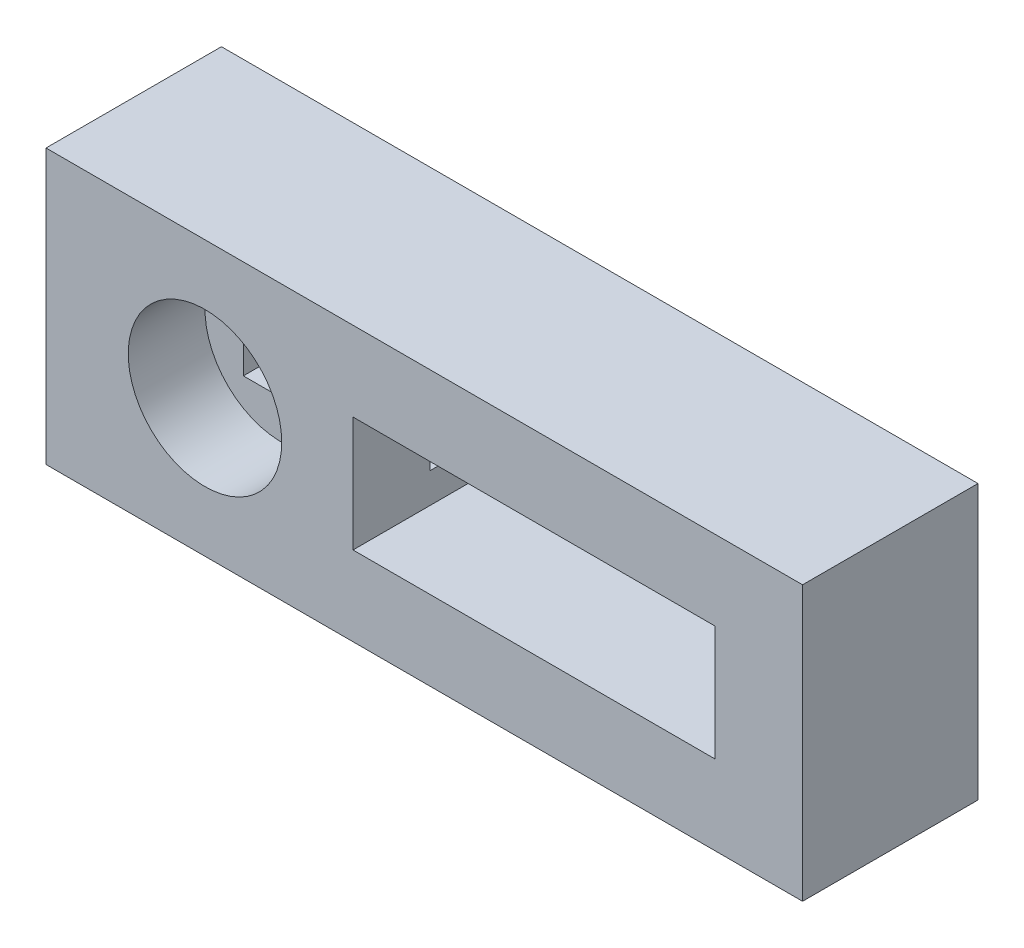
ISO-10303-21;
HEADER;
FILE_DESCRIPTION(('STEP AP214'),'2;1');
FILE_NAME('part.step','',(''),(''),'','','');
FILE_SCHEMA(('AUTOMOTIVE_DESIGN { 1 0 10303 214 1 1 1 1 }'));
ENDSEC;
DATA;
#1=APPLICATION_CONTEXT('core data for automotive mechanical design processes');
#2=APPLICATION_PROTOCOL_DEFINITION('international standard','automotive_design',2000,#1);
#3=PRODUCT_CONTEXT('',#1,'mechanical');
#4=PRODUCT('Part','Part','',(#3));
#5=PRODUCT_RELATED_PRODUCT_CATEGORY('part','',(#4));
#6=PRODUCT_DEFINITION_FORMATION('','',#4);
#7=PRODUCT_DEFINITION_CONTEXT('part definition',#1,'design');
#8=PRODUCT_DEFINITION('design','',#6,#7);
#9=PRODUCT_DEFINITION_SHAPE('','',#8);
#10=(LENGTH_UNIT() NAMED_UNIT(*) SI_UNIT(.MILLI.,.METRE.));
#11=(NAMED_UNIT(*) PLANE_ANGLE_UNIT() SI_UNIT($,.RADIAN.));
#12=(NAMED_UNIT(*) SI_UNIT($,.STERADIAN.) SOLID_ANGLE_UNIT());
#13=UNCERTAINTY_MEASURE_WITH_UNIT(LENGTH_MEASURE(1.E-05),#10,'distance_accuracy_value','');
#14=(GEOMETRIC_REPRESENTATION_CONTEXT(3) GLOBAL_UNCERTAINTY_ASSIGNED_CONTEXT((#13)) GLOBAL_UNIT_ASSIGNED_CONTEXT((#10,
#11,#12)) REPRESENTATION_CONTEXT('',''));
#15=CARTESIAN_POINT('',(0.,0.,0.));
#16=DIRECTION('',(0.,0.,1.));
#17=DIRECTION('',(1.,0.,0.));
#18=AXIS2_PLACEMENT_3D('',#15,#16,#17);
#19=CARTESIAN_POINT('',(0.,12.5,16.));
#20=DIRECTION('',(-1.,0.,0.));
#21=DIRECTION('',(0.,-1.,0.));
#22=AXIS2_PLACEMENT_3D('',#19,#20,#21);
#23=PLANE('',#22);
#24=DIRECTION('',(0.,1.,0.));
#25=VECTOR('',#24,1.);
#26=CARTESIAN_POINT('',(0.,12.5,0.));
#27=LINE('',#26,#25);
#28=CARTESIAN_POINT('',(0.,-12.5,0.));
#29=VERTEX_POINT('',#28);
#30=CARTESIAN_POINT('',(0.,12.5,0.));
#31=VERTEX_POINT('',#30);
#32=EDGE_CURVE('E335',#29,#31,#27,.T.);
#33=ORIENTED_EDGE('',*,*,#32,.T.);
#34=DIRECTION('',(0.,0.,-1.));
#35=VECTOR('',#34,1.);
#36=CARTESIAN_POINT('',(0.,12.5,16.));
#37=LINE('',#36,#35);
#38=CARTESIAN_POINT('',(0.,12.5,16.));
#39=VERTEX_POINT('',#38);
#40=EDGE_CURVE('E364',#39,#31,#37,.T.);
#41=ORIENTED_EDGE('',*,*,#40,.F.);
#42=DIRECTION('',(0.,1.,0.));
#43=VECTOR('',#42,1.);
#44=CARTESIAN_POINT('',(0.,12.5,16.));
#45=LINE('',#44,#43);
#46=CARTESIAN_POINT('',(0.,-12.5,16.));
#47=VERTEX_POINT('',#46);
#48=EDGE_CURVE('E338',#47,#39,#45,.T.);
#49=ORIENTED_EDGE('',*,*,#48,.F.);
#50=DIRECTION('',(0.,0.,-1.));
#51=VECTOR('',#50,1.);
#52=CARTESIAN_POINT('',(0.,-12.5,16.));
#53=LINE('',#52,#51);
#54=EDGE_CURVE('E348',#47,#29,#53,.T.);
#55=ORIENTED_EDGE('',*,*,#54,.T.);
#56=EDGE_LOOP('',(#33,#41,#49,#55));
#57=FACE_BOUND('',#56,.T.);
#58=ADVANCED_FACE('F33',(#57),#23,.F.);
#59=CARTESIAN_POINT('',(0.,12.5,16.));
#60=DIRECTION('',(0.,-1.,0.));
#61=DIRECTION('',(1.,0.,0.));
#62=AXIS2_PLACEMENT_3D('',#59,#60,#61);
#63=PLANE('',#62);
#64=DIRECTION('',(-1.,0.,0.));
#65=VECTOR('',#64,1.);
#66=CARTESIAN_POINT('',(0.,12.5,0.));
#67=LINE('',#66,#65);
#68=CARTESIAN_POINT('',(-69.,12.5,0.));
#69=VERTEX_POINT('',#68);
#70=EDGE_CURVE('E351',#31,#69,#67,.T.);
#71=ORIENTED_EDGE('',*,*,#70,.T.);
#72=DIRECTION('',(0.,0.,-1.));
#73=VECTOR('',#72,1.);
#74=CARTESIAN_POINT('',(-69.,12.5,16.));
#75=LINE('',#74,#73);
#76=CARTESIAN_POINT('',(-69.,12.5,16.));
#77=VERTEX_POINT('',#76);
#78=EDGE_CURVE('E361',#77,#69,#75,.T.);
#79=ORIENTED_EDGE('',*,*,#78,.F.);
#80=DIRECTION('',(-1.,0.,0.));
#81=VECTOR('',#80,1.);
#82=CARTESIAN_POINT('',(0.,12.5,16.));
#83=LINE('',#82,#81);
#84=EDGE_CURVE('E341',#39,#77,#83,.T.);
#85=ORIENTED_EDGE('',*,*,#84,.F.);
#86=ORIENTED_EDGE('',*,*,#40,.T.);
#87=EDGE_LOOP('',(#71,#79,#85,#86));
#88=FACE_BOUND('',#87,.T.);
#89=ADVANCED_FACE('F407',(#88),#63,.F.);
#90=CARTESIAN_POINT('',(-69.,12.5,16.));
#91=DIRECTION('',(1.,0.,0.));
#92=DIRECTION('',(0.,0.,-1.));
#93=AXIS2_PLACEMENT_3D('',#90,#91,#92);
#94=PLANE('',#93);
#95=DIRECTION('',(0.,-1.,0.));
#96=VECTOR('',#95,1.);
#97=CARTESIAN_POINT('',(-69.,12.5,0.));
#98=LINE('',#97,#96);
#99=CARTESIAN_POINT('',(-69.,-12.5,0.));
#100=VERTEX_POINT('',#99);
#101=EDGE_CURVE('E353',#69,#100,#98,.T.);
#102=ORIENTED_EDGE('',*,*,#101,.T.);
#103=DIRECTION('',(0.,0.,-1.));
#104=VECTOR('',#103,1.);
#105=CARTESIAN_POINT('',(-69.,-12.5,16.));
#106=LINE('',#105,#104);
#107=CARTESIAN_POINT('',(-69.,-12.5,16.));
#108=VERTEX_POINT('',#107);
#109=EDGE_CURVE('E358',#108,#100,#106,.T.);
#110=ORIENTED_EDGE('',*,*,#109,.F.);
#111=DIRECTION('',(0.,-1.,0.));
#112=VECTOR('',#111,1.);
#113=CARTESIAN_POINT('',(-69.,12.5,16.));
#114=LINE('',#113,#112);
#115=EDGE_CURVE('E344',#77,#108,#114,.T.);
#116=ORIENTED_EDGE('',*,*,#115,.F.);
#117=ORIENTED_EDGE('',*,*,#78,.T.);
#118=EDGE_LOOP('',(#102,#110,#116,#117));
#119=FACE_BOUND('',#118,.T.);
#120=ADVANCED_FACE('F412',(#119),#94,.F.);
#121=CARTESIAN_POINT('',(0.,-12.5,16.));
#122=DIRECTION('',(0.,1.,0.));
#123=DIRECTION('',(-1.,0.,0.));
#124=AXIS2_PLACEMENT_3D('',#121,#122,#123);
#125=PLANE('',#124);
#126=DIRECTION('',(1.,0.,0.));
#127=VECTOR('',#126,1.);
#128=CARTESIAN_POINT('',(0.,-12.5,0.));
#129=LINE('',#128,#127);
#130=EDGE_CURVE('E342',#100,#29,#129,.T.);
#131=ORIENTED_EDGE('',*,*,#130,.T.);
#132=ORIENTED_EDGE('',*,*,#54,.F.);
#133=DIRECTION('',(1.,0.,0.));
#134=VECTOR('',#133,1.);
#135=CARTESIAN_POINT('',(0.,-12.5,16.));
#136=LINE('',#135,#134);
#137=EDGE_CURVE('E346',#108,#47,#136,.T.);
#138=ORIENTED_EDGE('',*,*,#137,.F.);
#139=ORIENTED_EDGE('',*,*,#109,.T.);
#140=EDGE_LOOP('',(#131,#132,#138,#139));
#141=FACE_BOUND('',#140,.T.);
#142=ADVANCED_FACE('F427',(#141),#125,.F.);
#143=CARTESIAN_POINT('',(0.,0.,16.));
#144=DIRECTION('',(0.,0.,-1.));
#145=DIRECTION('',(-1.,0.,0.));
#146=AXIS2_PLACEMENT_3D('',#143,#144,#145);
#147=PLANE('',#146);
#148=DIRECTION('',(-1.,0.,0.));
#149=VECTOR('',#148,1.);
#150=CARTESIAN_POINT('',(-41.,-5.25000000000001,16.));
#151=LINE('',#150,#149);
#152=CARTESIAN_POINT('',(-8.00000000000001,-5.25000000000001,16.));
#153=VERTEX_POINT('',#152);
#154=CARTESIAN_POINT('',(-41.,-5.25000000000001,16.));
#155=VERTEX_POINT('',#154);
#156=EDGE_CURVE('E259',#153,#155,#151,.T.);
#157=ORIENTED_EDGE('',*,*,#156,.T.);
#158=DIRECTION('',(0.,1.,0.));
#159=VECTOR('',#158,1.);
#160=CARTESIAN_POINT('',(-41.,5.25000000000001,16.));
#161=LINE('',#160,#159);
#162=CARTESIAN_POINT('',(-41.,5.25000000000001,16.));
#163=VERTEX_POINT('',#162);
#164=EDGE_CURVE('E249',#155,#163,#161,.T.);
#165=ORIENTED_EDGE('',*,*,#164,.T.);
#166=DIRECTION('',(1.,0.,0.));
#167=VECTOR('',#166,1.);
#168=CARTESIAN_POINT('',(-41.,5.25000000000001,16.));
#169=LINE('',#168,#167);
#170=CARTESIAN_POINT('',(-8.00000000000001,5.24999999999999,16.));
#171=VERTEX_POINT('',#170);
#172=EDGE_CURVE('E252',#163,#171,#169,.T.);
#173=ORIENTED_EDGE('',*,*,#172,.T.);
#174=DIRECTION('',(0.,-1.,0.));
#175=VECTOR('',#174,1.);
#176=CARTESIAN_POINT('',(-8.00000000000001,5.24999999999999,16.));
#177=LINE('',#176,#175);
#178=EDGE_CURVE('E256',#171,#153,#177,.T.);
#179=ORIENTED_EDGE('',*,*,#178,.T.);
#180=EDGE_LOOP('',(#157,#165,#173,#179));
#181=FACE_BOUND('',#180,.T.);
#182=CARTESIAN_POINT('',(-54.5,0.,16.));
#183=DIRECTION('',(0.,0.,1.));
#184=DIRECTION('',(1.,0.,0.));
#185=AXIS2_PLACEMENT_3D('',#182,#183,#184);
#186=CIRCLE('',#185,7.);
#187=CARTESIAN_POINT('',(-47.5,0.,16.));
#188=VERTEX_POINT('',#187);
#189=EDGE_CURVE('E325',#188,#188,#186,.T.);
#190=ORIENTED_EDGE('',*,*,#189,.F.);
#191=EDGE_LOOP('',(#190));
#192=FACE_BOUND('',#191,.T.);
#193=ORIENTED_EDGE('',*,*,#48,.T.);
#194=ORIENTED_EDGE('',*,*,#84,.T.);
#195=ORIENTED_EDGE('',*,*,#115,.T.);
#196=ORIENTED_EDGE('',*,*,#137,.T.);
#197=EDGE_LOOP('',(#193,#194,#195,#196));
#198=FACE_BOUND('',#197,.T.);
#199=ADVANCED_FACE('F423',(#181,#192,#198),#147,.F.);
#200=CARTESIAN_POINT('',(0.,0.,0.));
#201=DIRECTION('',(0.,0.,-1.));
#202=DIRECTION('',(-1.,0.,0.));
#203=AXIS2_PLACEMENT_3D('',#200,#201,#202);
#204=PLANE('',#203);
#205=DIRECTION('',(1.,0.,0.));
#206=VECTOR('',#205,1.);
#207=CARTESIAN_POINT('',(-41.,2.49999999999999,0.));
#208=LINE('',#207,#206);
#209=CARTESIAN_POINT('',(-46.,2.5,0.));
#210=VERTEX_POINT('',#209);
#211=CARTESIAN_POINT('',(-41.,2.49999999999999,0.));
#212=VERTEX_POINT('',#211);
#213=EDGE_CURVE('E210',#210,#212,#208,.T.);
#214=ORIENTED_EDGE('',*,*,#213,.F.);
#215=DIRECTION('',(0.,1.,0.));
#216=VECTOR('',#215,1.);
#217=CARTESIAN_POINT('',(-46.,-2.5,0.));
#218=LINE('',#217,#216);
#219=CARTESIAN_POINT('',(-46.,-2.5,0.));
#220=VERTEX_POINT('',#219);
#221=EDGE_CURVE('E670',#220,#210,#218,.T.);
#222=ORIENTED_EDGE('',*,*,#221,.F.);
#223=DIRECTION('',(-1.,0.,0.));
#224=VECTOR('',#223,1.);
#225=CARTESIAN_POINT('',(-41.,-2.5,0.));
#226=LINE('',#225,#224);
#227=CARTESIAN_POINT('',(-41.,-2.5,0.));
#228=VERTEX_POINT('',#227);
#229=EDGE_CURVE('E243',#228,#220,#226,.T.);
#230=ORIENTED_EDGE('',*,*,#229,.F.);
#231=DIRECTION('',(0.,1.,0.));
#232=VECTOR('',#231,1.);
#233=CARTESIAN_POINT('',(-41.,5.25000000000001,0.));
#234=LINE('',#233,#232);
#235=CARTESIAN_POINT('',(-41.,-5.25000000000001,0.));
#236=VERTEX_POINT('',#235);
#237=EDGE_CURVE('E215',#236,#228,#234,.T.);
#238=ORIENTED_EDGE('',*,*,#237,.F.);
#239=DIRECTION('',(-1.,0.,0.));
#240=VECTOR('',#239,1.);
#241=CARTESIAN_POINT('',(-41.,-5.25000000000001,0.));
#242=LINE('',#241,#240);
#243=CARTESIAN_POINT('',(-8.00000000000001,-5.25000000000001,0.));
#244=VERTEX_POINT('',#243);
#245=EDGE_CURVE('E253',#244,#236,#242,.T.);
#246=ORIENTED_EDGE('',*,*,#245,.F.);
#247=DIRECTION('',(0.,-1.,0.));
#248=VECTOR('',#247,1.);
#249=CARTESIAN_POINT('',(-8.00000000000001,5.24999999999999,0.));
#250=LINE('',#249,#248);
#251=CARTESIAN_POINT('',(-8.,-2.5,0.));
#252=VERTEX_POINT('',#251);
#253=EDGE_CURVE('E268',#252,#244,#250,.T.);
#254=ORIENTED_EDGE('',*,*,#253,.F.);
#255=DIRECTION('',(-1.,0.,0.));
#256=VECTOR('',#255,1.);
#257=CARTESIAN_POINT('',(-8.,-2.5,0.));
#258=LINE('',#257,#256);
#259=CARTESIAN_POINT('',(-3.,-2.5,0.));
#260=VERTEX_POINT('',#259);
#261=EDGE_CURVE('E225',#260,#252,#258,.T.);
#262=ORIENTED_EDGE('',*,*,#261,.F.);
#263=DIRECTION('',(0.,-1.,0.));
#264=VECTOR('',#263,1.);
#265=CARTESIAN_POINT('',(-3.,-2.5,0.));
#266=LINE('',#265,#264);
#267=CARTESIAN_POINT('',(-3.,2.5,0.));
#268=VERTEX_POINT('',#267);
#269=EDGE_CURVE('E235',#268,#260,#266,.T.);
#270=ORIENTED_EDGE('',*,*,#269,.F.);
#271=DIRECTION('',(1.,0.,0.));
#272=VECTOR('',#271,1.);
#273=CARTESIAN_POINT('',(-8.,2.5,0.));
#274=LINE('',#273,#272);
#275=CARTESIAN_POINT('',(-8.,2.5,0.));
#276=VERTEX_POINT('',#275);
#277=EDGE_CURVE('E232',#276,#268,#274,.T.);
#278=ORIENTED_EDGE('',*,*,#277,.F.);
#279=CARTESIAN_POINT('',(-8.00000000000001,5.24999999999999,0.));
#280=VERTEX_POINT('',#279);
#281=EDGE_CURVE('E269',#280,#276,#250,.T.);
#282=ORIENTED_EDGE('',*,*,#281,.F.);
#283=DIRECTION('',(1.,0.,0.));
#284=VECTOR('',#283,1.);
#285=CARTESIAN_POINT('',(-41.,5.25000000000001,0.));
#286=LINE('',#285,#284);
#287=CARTESIAN_POINT('',(-41.,5.25000000000001,0.));
#288=VERTEX_POINT('',#287);
#289=EDGE_CURVE('E264',#288,#280,#286,.T.);
#290=ORIENTED_EDGE('',*,*,#289,.F.);
#291=EDGE_CURVE('E265',#212,#288,#234,.T.);
#292=ORIENTED_EDGE('',*,*,#291,.F.);
#293=EDGE_LOOP('',(#214,#222,#230,#238,#246,#254,#262,#270,#278,#282,#290,#292));
#294=FACE_BOUND('',#293,.T.);
#295=DIRECTION('',(0.,1.,0.));
#296=VECTOR('',#295,1.);
#297=CARTESIAN_POINT('',(-61.,0.,0.));
#298=LINE('',#297,#296);
#299=CARTESIAN_POINT('',(-61.,-6.5,0.));
#300=VERTEX_POINT('',#299);
#301=CARTESIAN_POINT('',(-61.,6.5,0.));
#302=VERTEX_POINT('',#301);
#303=EDGE_CURVE('E11',#300,#302,#298,.T.);
#304=ORIENTED_EDGE('',*,*,#303,.F.);
#305=DIRECTION('',(-1.,0.,0.));
#306=VECTOR('',#305,1.);
#307=CARTESIAN_POINT('',(0.,-6.5,0.));
#308=LINE('',#307,#306);
#309=CARTESIAN_POINT('',(-48.,-6.5,0.));
#310=VERTEX_POINT('',#309);
#311=EDGE_CURVE('E367',#310,#300,#308,.T.);
#312=ORIENTED_EDGE('',*,*,#311,.F.);
#313=DIRECTION('',(0.,-1.,0.));
#314=VECTOR('',#313,1.);
#315=CARTESIAN_POINT('',(-48.,0.,0.));
#316=LINE('',#315,#314);
#317=CARTESIAN_POINT('',(-48.,6.5,0.));
#318=VERTEX_POINT('',#317);
#319=EDGE_CURVE('E369',#318,#310,#316,.T.);
#320=ORIENTED_EDGE('',*,*,#319,.F.);
#321=DIRECTION('',(1.,0.,0.));
#322=VECTOR('',#321,1.);
#323=CARTESIAN_POINT('',(0.,6.5,0.));
#324=LINE('',#323,#322);
#325=EDGE_CURVE('E40',#302,#318,#324,.T.);
#326=ORIENTED_EDGE('',*,*,#325,.F.);
#327=EDGE_LOOP('',(#304,#312,#320,#326));
#328=FACE_BOUND('',#327,.T.);
#329=ORIENTED_EDGE('',*,*,#32,.F.);
#330=ORIENTED_EDGE('',*,*,#130,.F.);
#331=ORIENTED_EDGE('',*,*,#101,.F.);
#332=ORIENTED_EDGE('',*,*,#70,.F.);
#333=EDGE_LOOP('',(#329,#330,#331,#332));
#334=FACE_BOUND('',#333,.T.);
#335=ADVANCED_FACE('F384',(#294,#328,#334),#204,.T.);
#336=CARTESIAN_POINT('',(-54.5,0.,9.));
#337=DIRECTION('',(0.,0.,1.));
#338=DIRECTION('',(1.,0.,0.));
#339=AXIS2_PLACEMENT_3D('',#336,#337,#338);
#340=CYLINDRICAL_SURFACE('',#339,7.);
#341=CARTESIAN_POINT('',(-54.5,0.,9.));
#342=DIRECTION('',(0.,0.,1.));
#343=DIRECTION('',(1.,0.,0.));
#344=AXIS2_PLACEMENT_3D('',#341,#342,#343);
#345=CIRCLE('',#344,7.);
#346=CARTESIAN_POINT('',(-47.5,0.,9.));
#347=VERTEX_POINT('',#346);
#348=EDGE_CURVE('E332',#347,#347,#345,.T.);
#349=ORIENTED_EDGE('',*,*,#348,.F.);
#350=EDGE_LOOP('',(#349));
#351=FACE_BOUND('',#350,.T.);
#352=ORIENTED_EDGE('',*,*,#189,.T.);
#353=EDGE_LOOP('',(#352));
#354=FACE_BOUND('',#353,.T.);
#355=ADVANCED_FACE('F438',(#351,#354),#340,.F.);
#356=CARTESIAN_POINT('',(-54.5,0.,9.));
#357=DIRECTION('',(0.,0.,1.));
#358=DIRECTION('',(1.,0.,0.));
#359=AXIS2_PLACEMENT_3D('',#356,#357,#358);
#360=PLANE('',#359);
#361=DIRECTION('',(0.,-1.,0.));
#362=VECTOR('',#361,1.);
#363=CARTESIAN_POINT('',(-58.,-3.5,9.));
#364=LINE('',#363,#362);
#365=CARTESIAN_POINT('',(-58.,3.5,9.));
#366=VERTEX_POINT('',#365);
#367=CARTESIAN_POINT('',(-58.,-3.5,9.));
#368=VERTEX_POINT('',#367);
#369=EDGE_CURVE('E298',#366,#368,#364,.T.);
#370=ORIENTED_EDGE('',*,*,#369,.F.);
#371=DIRECTION('',(-1.,0.,0.));
#372=VECTOR('',#371,1.);
#373=CARTESIAN_POINT('',(-58.,3.5,9.));
#374=LINE('',#373,#372);
#375=CARTESIAN_POINT('',(-51.,3.5,9.));
#376=VERTEX_POINT('',#375);
#377=EDGE_CURVE('E307',#376,#366,#374,.T.);
#378=ORIENTED_EDGE('',*,*,#377,.F.);
#379=DIRECTION('',(0.,1.,0.));
#380=VECTOR('',#379,1.);
#381=CARTESIAN_POINT('',(-51.,-3.5,9.));
#382=LINE('',#381,#380);
#383=CARTESIAN_POINT('',(-51.,-3.5,9.));
#384=VERTEX_POINT('',#383);
#385=EDGE_CURVE('E319',#384,#376,#382,.T.);
#386=ORIENTED_EDGE('',*,*,#385,.F.);
#387=DIRECTION('',(1.,0.,0.));
#388=VECTOR('',#387,1.);
#389=CARTESIAN_POINT('',(-58.,-3.5,9.));
#390=LINE('',#389,#388);
#391=EDGE_CURVE('E316',#368,#384,#390,.T.);
#392=ORIENTED_EDGE('',*,*,#391,.F.);
#393=EDGE_LOOP('',(#370,#378,#386,#392));
#394=FACE_BOUND('',#393,.T.);
#395=ORIENTED_EDGE('',*,*,#348,.T.);
#396=EDGE_LOOP('',(#395));
#397=FACE_BOUND('',#396,.T.);
#398=ADVANCED_FACE('F445',(#394,#397),#360,.T.);
#399=CARTESIAN_POINT('',(-58.,-3.5,7.));
#400=DIRECTION('',(-1.,0.,0.));
#401=DIRECTION('',(0.,0.,1.));
#402=AXIS2_PLACEMENT_3D('',#399,#400,#401);
#403=PLANE('',#402);
#404=ORIENTED_EDGE('',*,*,#369,.T.);
#405=DIRECTION('',(0.,0.,1.));
#406=VECTOR('',#405,1.);
#407=CARTESIAN_POINT('',(-58.,-3.5,7.));
#408=LINE('',#407,#406);
#409=CARTESIAN_POINT('',(-58.,-3.5,7.));
#410=VERTEX_POINT('',#409);
#411=EDGE_CURVE('E313',#410,#368,#408,.T.);
#412=ORIENTED_EDGE('',*,*,#411,.F.);
#413=DIRECTION('',(0.,-1.,0.));
#414=VECTOR('',#413,1.);
#415=CARTESIAN_POINT('',(-58.,-3.5,7.));
#416=LINE('',#415,#414);
#417=CARTESIAN_POINT('',(-58.,3.5,7.));
#418=VERTEX_POINT('',#417);
#419=EDGE_CURVE('E304',#418,#410,#416,.T.);
#420=ORIENTED_EDGE('',*,*,#419,.F.);
#421=DIRECTION('',(0.,0.,1.));
#422=VECTOR('',#421,1.);
#423=CARTESIAN_POINT('',(-58.,3.5,7.));
#424=LINE('',#423,#422);
#425=EDGE_CURVE('E323',#418,#366,#424,.T.);
#426=ORIENTED_EDGE('',*,*,#425,.T.);
#427=EDGE_LOOP('',(#404,#412,#420,#426));
#428=FACE_BOUND('',#427,.T.);
#429=ADVANCED_FACE('F449',(#428),#403,.F.);
#430=CARTESIAN_POINT('',(-58.,3.5,7.));
#431=DIRECTION('',(0.,1.,0.));
#432=DIRECTION('',(0.,0.,1.));
#433=AXIS2_PLACEMENT_3D('',#430,#431,#432);
#434=PLANE('',#433);
#435=ORIENTED_EDGE('',*,*,#377,.T.);
#436=ORIENTED_EDGE('',*,*,#425,.F.);
#437=DIRECTION('',(-1.,0.,0.));
#438=VECTOR('',#437,1.);
#439=CARTESIAN_POINT('',(-58.,3.5,7.));
#440=LINE('',#439,#438);
#441=CARTESIAN_POINT('',(-51.,3.5,7.));
#442=VERTEX_POINT('',#441);
#443=EDGE_CURVE('E311',#442,#418,#440,.T.);
#444=ORIENTED_EDGE('',*,*,#443,.F.);
#445=DIRECTION('',(0.,0.,1.));
#446=VECTOR('',#445,1.);
#447=CARTESIAN_POINT('',(-51.,3.5,7.));
#448=LINE('',#447,#446);
#449=EDGE_CURVE('E326',#442,#376,#448,.T.);
#450=ORIENTED_EDGE('',*,*,#449,.T.);
#451=EDGE_LOOP('',(#435,#436,#444,#450));
#452=FACE_BOUND('',#451,.T.);
#453=ADVANCED_FACE('F453',(#452),#434,.F.);
#454=CARTESIAN_POINT('',(-51.,-3.5,7.));
#455=DIRECTION('',(1.,0.,0.));
#456=DIRECTION('',(0.,0.,-1.));
#457=AXIS2_PLACEMENT_3D('',#454,#455,#456);
#458=PLANE('',#457);
#459=ORIENTED_EDGE('',*,*,#385,.T.);
#460=ORIENTED_EDGE('',*,*,#449,.F.);
#461=DIRECTION('',(0.,1.,0.));
#462=VECTOR('',#461,1.);
#463=CARTESIAN_POINT('',(-51.,-3.5,7.));
#464=LINE('',#463,#462);
#465=CARTESIAN_POINT('',(-51.,-3.5,7.));
#466=VERTEX_POINT('',#465);
#467=EDGE_CURVE('E309',#466,#442,#464,.T.);
#468=ORIENTED_EDGE('',*,*,#467,.F.);
#469=DIRECTION('',(0.,0.,1.));
#470=VECTOR('',#469,1.);
#471=CARTESIAN_POINT('',(-51.,-3.5,7.));
#472=LINE('',#471,#470);
#473=EDGE_CURVE('E329',#466,#384,#472,.T.);
#474=ORIENTED_EDGE('',*,*,#473,.T.);
#475=EDGE_LOOP('',(#459,#460,#468,#474));
#476=FACE_BOUND('',#475,.T.);
#477=ADVANCED_FACE('F458',(#476),#458,.F.);
#478=CARTESIAN_POINT('',(-58.,-3.5,7.));
#479=DIRECTION('',(0.,-1.,0.));
#480=DIRECTION('',(0.,0.,-1.));
#481=AXIS2_PLACEMENT_3D('',#478,#479,#480);
#482=PLANE('',#481);
#483=ORIENTED_EDGE('',*,*,#391,.T.);
#484=ORIENTED_EDGE('',*,*,#473,.F.);
#485=DIRECTION('',(1.,0.,0.));
#486=VECTOR('',#485,1.);
#487=CARTESIAN_POINT('',(-58.,-3.5,7.));
#488=LINE('',#487,#486);
#489=EDGE_CURVE('E306',#410,#466,#488,.T.);
#490=ORIENTED_EDGE('',*,*,#489,.F.);
#491=ORIENTED_EDGE('',*,*,#411,.T.);
#492=EDGE_LOOP('',(#483,#484,#490,#491));
#493=FACE_BOUND('',#492,.T.);
#494=ADVANCED_FACE('F455',(#493),#482,.F.);
#495=CARTESIAN_POINT('',(-61.,6.5,-0.999999999999999));
#496=DIRECTION('',(-1.,0.,0.));
#497=DIRECTION('',(0.,0.,1.));
#498=AXIS2_PLACEMENT_3D('',#495,#496,#497);
#499=PLANE('',#498);
#500=ORIENTED_EDGE('',*,*,#303,.T.);
#501=DIRECTION('',(0.,0.,1.));
#502=VECTOR('',#501,1.);
#503=CARTESIAN_POINT('',(-61.,6.5,-0.999999999999999));
#504=LINE('',#503,#502);
#505=CARTESIAN_POINT('',(-61.,6.5,7.));
#506=VERTEX_POINT('',#505);
#507=EDGE_CURVE('E296',#302,#506,#504,.T.);
#508=ORIENTED_EDGE('',*,*,#507,.T.);
#509=DIRECTION('',(0.,-1.,0.));
#510=VECTOR('',#509,1.);
#511=CARTESIAN_POINT('',(-61.,6.5,7.));
#512=LINE('',#511,#510);
#513=CARTESIAN_POINT('',(-61.,-6.5,7.));
#514=VERTEX_POINT('',#513);
#515=EDGE_CURVE('E276',#506,#514,#512,.T.);
#516=ORIENTED_EDGE('',*,*,#515,.T.);
#517=DIRECTION('',(0.,0.,1.));
#518=VECTOR('',#517,1.);
#519=CARTESIAN_POINT('',(-61.,-6.5,-0.999999999999999));
#520=LINE('',#519,#518);
#521=EDGE_CURVE('E295',#300,#514,#520,.T.);
#522=ORIENTED_EDGE('',*,*,#521,.F.);
#523=EDGE_LOOP('',(#500,#508,#516,#522));
#524=FACE_BOUND('',#523,.T.);
#525=ADVANCED_FACE('F391',(#524),#499,.F.);
#526=CARTESIAN_POINT('',(-61.,6.5,-0.999999999999999));
#527=DIRECTION('',(0.,1.,0.));
#528=DIRECTION('',(-1.,0.,0.));
#529=AXIS2_PLACEMENT_3D('',#526,#527,#528);
#530=PLANE('',#529);
#531=ORIENTED_EDGE('',*,*,#325,.T.);
#532=DIRECTION('',(0.,0.,1.));
#533=VECTOR('',#532,1.);
#534=CARTESIAN_POINT('',(-48.,6.5,-0.999999999999999));
#535=LINE('',#534,#533);
#536=CARTESIAN_POINT('',(-48.,6.5,7.));
#537=VERTEX_POINT('',#536);
#538=EDGE_CURVE('E299',#318,#537,#535,.T.);
#539=ORIENTED_EDGE('',*,*,#538,.T.);
#540=DIRECTION('',(-1.,0.,0.));
#541=VECTOR('',#540,1.);
#542=CARTESIAN_POINT('',(-61.,6.5,7.));
#543=LINE('',#542,#541);
#544=EDGE_CURVE('E292',#537,#506,#543,.T.);
#545=ORIENTED_EDGE('',*,*,#544,.T.);
#546=ORIENTED_EDGE('',*,*,#507,.F.);
#547=EDGE_LOOP('',(#531,#539,#545,#546));
#548=FACE_BOUND('',#547,.T.);
#549=ADVANCED_FACE('F375',(#548),#530,.F.);
#550=CARTESIAN_POINT('',(-48.,6.5,-0.999999999999999));
#551=DIRECTION('',(1.,0.,0.));
#552=DIRECTION('',(0.,0.,-1.));
#553=AXIS2_PLACEMENT_3D('',#550,#551,#552);
#554=PLANE('',#553);
#555=ORIENTED_EDGE('',*,*,#319,.T.);
#556=DIRECTION('',(0.,0.,1.));
#557=VECTOR('',#556,1.);
#558=CARTESIAN_POINT('',(-48.,-6.5,-0.999999999999999));
#559=LINE('',#558,#557);
#560=CARTESIAN_POINT('',(-48.,-6.5,7.));
#561=VERTEX_POINT('',#560);
#562=EDGE_CURVE('E301',#310,#561,#559,.T.);
#563=ORIENTED_EDGE('',*,*,#562,.T.);
#564=DIRECTION('',(0.,1.,0.));
#565=VECTOR('',#564,1.);
#566=CARTESIAN_POINT('',(-48.,6.5,7.));
#567=LINE('',#566,#565);
#568=EDGE_CURVE('E289',#561,#537,#567,.T.);
#569=ORIENTED_EDGE('',*,*,#568,.T.);
#570=ORIENTED_EDGE('',*,*,#538,.F.);
#571=EDGE_LOOP('',(#555,#563,#569,#570));
#572=FACE_BOUND('',#571,.T.);
#573=ADVANCED_FACE('F380',(#572),#554,.F.);
#574=CARTESIAN_POINT('',(-61.,-6.5,-0.999999999999999));
#575=DIRECTION('',(0.,-1.,0.));
#576=DIRECTION('',(0.,0.,-1.));
#577=AXIS2_PLACEMENT_3D('',#574,#575,#576);
#578=PLANE('',#577);
#579=ORIENTED_EDGE('',*,*,#311,.T.);
#580=ORIENTED_EDGE('',*,*,#521,.T.);
#581=DIRECTION('',(1.,0.,0.));
#582=VECTOR('',#581,1.);
#583=CARTESIAN_POINT('',(-61.,-6.5,7.));
#584=LINE('',#583,#582);
#585=EDGE_CURVE('E286',#514,#561,#584,.T.);
#586=ORIENTED_EDGE('',*,*,#585,.T.);
#587=ORIENTED_EDGE('',*,*,#562,.F.);
#588=EDGE_LOOP('',(#579,#580,#586,#587));
#589=FACE_BOUND('',#588,.T.);
#590=ADVANCED_FACE('F388',(#589),#578,.F.);
#591=CARTESIAN_POINT('',(0.,0.,7.));
#592=DIRECTION('',(0.,0.,1.));
#593=DIRECTION('',(1.,0.,0.));
#594=AXIS2_PLACEMENT_3D('',#591,#592,#593);
#595=PLANE('',#594);
#596=ORIENTED_EDGE('',*,*,#419,.T.);
#597=ORIENTED_EDGE('',*,*,#489,.T.);
#598=ORIENTED_EDGE('',*,*,#467,.T.);
#599=ORIENTED_EDGE('',*,*,#443,.T.);
#600=EDGE_LOOP('',(#596,#597,#598,#599));
#601=FACE_BOUND('',#600,.T.);
#602=ORIENTED_EDGE('',*,*,#515,.F.);
#603=ORIENTED_EDGE('',*,*,#544,.F.);
#604=ORIENTED_EDGE('',*,*,#568,.F.);
#605=ORIENTED_EDGE('',*,*,#585,.F.);
#606=EDGE_LOOP('',(#602,#603,#604,#605));
#607=FACE_BOUND('',#606,.T.);
#608=ADVANCED_FACE('F394',(#601,#607),#595,.F.);
#609=CARTESIAN_POINT('',(-41.,5.25000000000001,16.));
#610=DIRECTION('',(-1.,0.,0.));
#611=DIRECTION('',(0.,-1.,0.));
#612=AXIS2_PLACEMENT_3D('',#609,#610,#611);
#613=PLANE('',#612);
#614=DIRECTION('',(0.,-1.,0.));
#615=VECTOR('',#614,1.);
#616=CARTESIAN_POINT('',(-41.,-2.5,9.));
#617=LINE('',#616,#615);
#618=CARTESIAN_POINT('',(-41.,2.5,9.));
#619=VERTEX_POINT('',#618);
#620=CARTESIAN_POINT('',(-41.,-2.5,9.));
#621=VERTEX_POINT('',#620);
#622=EDGE_CURVE('E204',#619,#621,#617,.T.);
#623=ORIENTED_EDGE('',*,*,#622,.F.);
#624=DIRECTION('',(0.,0.,-1.));
#625=VECTOR('',#624,1.);
#626=CARTESIAN_POINT('',(-41.,2.49999999999999,9.));
#627=LINE('',#626,#625);
#628=EDGE_CURVE('E674',#619,#212,#627,.T.);
#629=ORIENTED_EDGE('',*,*,#628,.T.);
#630=ORIENTED_EDGE('',*,*,#291,.T.);
#631=DIRECTION('',(0.,0.,-1.));
#632=VECTOR('',#631,1.);
#633=CARTESIAN_POINT('',(-41.,5.25000000000001,16.));
#634=LINE('',#633,#632);
#635=EDGE_CURVE('E262',#163,#288,#634,.T.);
#636=ORIENTED_EDGE('',*,*,#635,.F.);
#637=ORIENTED_EDGE('',*,*,#164,.F.);
#638=DIRECTION('',(0.,0.,-1.));
#639=VECTOR('',#638,1.);
#640=CARTESIAN_POINT('',(-41.,-5.25000000000001,16.));
#641=LINE('',#640,#639);
#642=EDGE_CURVE('E274',#155,#236,#641,.T.);
#643=ORIENTED_EDGE('',*,*,#642,.T.);
#644=ORIENTED_EDGE('',*,*,#237,.T.);
#645=DIRECTION('',(0.,0.,-1.));
#646=VECTOR('',#645,1.);
#647=CARTESIAN_POINT('',(-41.,-2.5,9.));
#648=LINE('',#647,#646);
#649=EDGE_CURVE('E199',#621,#228,#648,.T.);
#650=ORIENTED_EDGE('',*,*,#649,.F.);
#651=EDGE_LOOP('',(#623,#629,#630,#636,#637,#643,#644,#650));
#652=FACE_BOUND('',#651,.T.);
#653=ADVANCED_FACE('F213',(#652),#613,.F.);
#654=CARTESIAN_POINT('',(-41.,-5.25000000000001,16.));
#655=DIRECTION('',(0.,-1.,0.));
#656=DIRECTION('',(1.,0.,0.));
#657=AXIS2_PLACEMENT_3D('',#654,#655,#656);
#658=PLANE('',#657);
#659=ORIENTED_EDGE('',*,*,#245,.T.);
#660=ORIENTED_EDGE('',*,*,#642,.F.);
#661=ORIENTED_EDGE('',*,*,#156,.F.);
#662=DIRECTION('',(0.,0.,-1.));
#663=VECTOR('',#662,1.);
#664=CARTESIAN_POINT('',(-8.00000000000001,-5.25000000000001,16.));
#665=LINE('',#664,#663);
#666=EDGE_CURVE('E277',#153,#244,#665,.T.);
#667=ORIENTED_EDGE('',*,*,#666,.T.);
#668=EDGE_LOOP('',(#659,#660,#661,#667));
#669=FACE_BOUND('',#668,.T.);
#670=ADVANCED_FACE('F402',(#669),#658,.F.);
#671=CARTESIAN_POINT('',(-8.00000000000001,5.24999999999999,16.));
#672=DIRECTION('',(1.,0.,0.));
#673=DIRECTION('',(0.,1.,0.));
#674=AXIS2_PLACEMENT_3D('',#671,#672,#673);
#675=PLANE('',#674);
#676=DIRECTION('',(0.,1.,0.));
#677=VECTOR('',#676,1.);
#678=CARTESIAN_POINT('',(-8.,-2.5,9.));
#679=LINE('',#678,#677);
#680=CARTESIAN_POINT('',(-8.00000000000001,-2.5,9.));
#681=VERTEX_POINT('',#680);
#682=CARTESIAN_POINT('',(-8.,2.5,9.));
#683=VERTEX_POINT('',#682);
#684=EDGE_CURVE('E222',#681,#683,#679,.T.);
#685=ORIENTED_EDGE('',*,*,#684,.F.);
#686=DIRECTION('',(0.,0.,-1.));
#687=VECTOR('',#686,1.);
#688=CARTESIAN_POINT('',(-8.,-2.5,9.));
#689=LINE('',#688,#687);
#690=EDGE_CURVE('E240',#681,#252,#689,.T.);
#691=ORIENTED_EDGE('',*,*,#690,.T.);
#692=ORIENTED_EDGE('',*,*,#253,.T.);
#693=ORIENTED_EDGE('',*,*,#666,.F.);
#694=ORIENTED_EDGE('',*,*,#178,.F.);
#695=DIRECTION('',(0.,0.,-1.));
#696=VECTOR('',#695,1.);
#697=CARTESIAN_POINT('',(-8.00000000000001,5.24999999999999,16.));
#698=LINE('',#697,#696);
#699=EDGE_CURVE('E280',#171,#280,#698,.T.);
#700=ORIENTED_EDGE('',*,*,#699,.T.);
#701=ORIENTED_EDGE('',*,*,#281,.T.);
#702=DIRECTION('',(0.,0.,-1.));
#703=VECTOR('',#702,1.);
#704=CARTESIAN_POINT('',(-8.,2.5,9.));
#705=LINE('',#704,#703);
#706=EDGE_CURVE('E231',#683,#276,#705,.T.);
#707=ORIENTED_EDGE('',*,*,#706,.F.);
#708=EDGE_LOOP('',(#685,#691,#692,#693,#694,#700,#701,#707));
#709=FACE_BOUND('',#708,.T.);
#710=ADVANCED_FACE('F504',(#709),#675,.F.);
#711=CARTESIAN_POINT('',(-41.,5.25000000000001,16.));
#712=DIRECTION('',(0.,1.,0.));
#713=DIRECTION('',(-1.,0.,0.));
#714=AXIS2_PLACEMENT_3D('',#711,#712,#713);
#715=PLANE('',#714);
#716=ORIENTED_EDGE('',*,*,#289,.T.);
#717=ORIENTED_EDGE('',*,*,#699,.F.);
#718=ORIENTED_EDGE('',*,*,#172,.F.);
#719=ORIENTED_EDGE('',*,*,#635,.T.);
#720=EDGE_LOOP('',(#716,#717,#718,#719));
#721=FACE_BOUND('',#720,.T.);
#722=ADVANCED_FACE('F512',(#721),#715,.F.);
#723=CARTESIAN_POINT('',(-8.,-2.5,9.));
#724=DIRECTION('',(0.,-1.,0.));
#725=DIRECTION('',(1.,0.,0.));
#726=AXIS2_PLACEMENT_3D('',#723,#724,#725);
#727=PLANE('',#726);
#728=ORIENTED_EDGE('',*,*,#261,.T.);
#729=ORIENTED_EDGE('',*,*,#690,.F.);
#730=DIRECTION('',(-1.,0.,0.));
#731=VECTOR('',#730,1.);
#732=CARTESIAN_POINT('',(-8.,-2.5,9.));
#733=LINE('',#732,#731);
#734=CARTESIAN_POINT('',(-3.,-2.5,9.));
#735=VERTEX_POINT('',#734);
#736=EDGE_CURVE('E55',#735,#681,#733,.T.);
#737=ORIENTED_EDGE('',*,*,#736,.F.);
#738=DIRECTION('',(0.,0.,-1.));
#739=VECTOR('',#738,1.);
#740=CARTESIAN_POINT('',(-3.,-2.5,9.));
#741=LINE('',#740,#739);
#742=EDGE_CURVE('E244',#735,#260,#741,.T.);
#743=ORIENTED_EDGE('',*,*,#742,.T.);
#744=EDGE_LOOP('',(#728,#729,#737,#743));
#745=FACE_BOUND('',#744,.T.);
#746=ADVANCED_FACE('F517',(#745),#727,.F.);
#747=CARTESIAN_POINT('',(-3.,-2.5,9.));
#748=DIRECTION('',(1.,0.,0.));
#749=DIRECTION('',(0.,1.,0.));
#750=AXIS2_PLACEMENT_3D('',#747,#748,#749);
#751=PLANE('',#750);
#752=ORIENTED_EDGE('',*,*,#269,.T.);
#753=ORIENTED_EDGE('',*,*,#742,.F.);
#754=DIRECTION('',(0.,-1.,0.));
#755=VECTOR('',#754,1.);
#756=CARTESIAN_POINT('',(-3.,-2.5,9.));
#757=LINE('',#756,#755);
#758=CARTESIAN_POINT('',(-3.,2.5,9.));
#759=VERTEX_POINT('',#758);
#760=EDGE_CURVE('E228',#759,#735,#757,.T.);
#761=ORIENTED_EDGE('',*,*,#760,.F.);
#762=DIRECTION('',(0.,0.,-1.));
#763=VECTOR('',#762,1.);
#764=CARTESIAN_POINT('',(-3.,2.5,9.));
#765=LINE('',#764,#763);
#766=EDGE_CURVE('E246',#759,#268,#765,.T.);
#767=ORIENTED_EDGE('',*,*,#766,.T.);
#768=EDGE_LOOP('',(#752,#753,#761,#767));
#769=FACE_BOUND('',#768,.T.);
#770=ADVANCED_FACE('F545',(#769),#751,.F.);
#771=CARTESIAN_POINT('',(-8.,2.5,9.));
#772=DIRECTION('',(0.,1.,0.));
#773=DIRECTION('',(-1.,0.,0.));
#774=AXIS2_PLACEMENT_3D('',#771,#772,#773);
#775=PLANE('',#774);
#776=ORIENTED_EDGE('',*,*,#277,.T.);
#777=ORIENTED_EDGE('',*,*,#766,.F.);
#778=DIRECTION('',(1.,0.,0.));
#779=VECTOR('',#778,1.);
#780=CARTESIAN_POINT('',(-8.,2.5,9.));
#781=LINE('',#780,#779);
#782=EDGE_CURVE('E224',#683,#759,#781,.T.);
#783=ORIENTED_EDGE('',*,*,#782,.F.);
#784=ORIENTED_EDGE('',*,*,#706,.T.);
#785=EDGE_LOOP('',(#776,#777,#783,#784));
#786=FACE_BOUND('',#785,.T.);
#787=ADVANCED_FACE('F555',(#786),#775,.F.);
#788=CARTESIAN_POINT('',(0.,0.,9.));
#789=DIRECTION('',(0.,0.,-1.));
#790=DIRECTION('',(-1.,0.,0.));
#791=AXIS2_PLACEMENT_3D('',#788,#789,#790);
#792=PLANE('',#791);
#793=CARTESIAN_POINT('',(-5.5,0.,9.));
#794=DIRECTION('',(0.,0.,-1.));
#795=DIRECTION('',(-1.,0.,0.));
#796=AXIS2_PLACEMENT_3D('',#793,#794,#795);
#797=CIRCLE('',#796,0.75);
#798=CARTESIAN_POINT('',(-6.25,0.,9.));
#799=VERTEX_POINT('',#798);
#800=EDGE_CURVE('E660',#799,#799,#797,.T.);
#801=ORIENTED_EDGE('',*,*,#800,.F.);
#802=EDGE_LOOP('',(#801));
#803=FACE_BOUND('',#802,.T.);
#804=ORIENTED_EDGE('',*,*,#684,.T.);
#805=ORIENTED_EDGE('',*,*,#782,.T.);
#806=ORIENTED_EDGE('',*,*,#760,.T.);
#807=ORIENTED_EDGE('',*,*,#736,.T.);
#808=EDGE_LOOP('',(#804,#805,#806,#807));
#809=FACE_BOUND('',#808,.T.);
#810=ADVANCED_FACE('F565',(#803,#809),#792,.T.);
#811=CARTESIAN_POINT('',(-41.,2.49999999999999,9.));
#812=DIRECTION('',(0.,1.,0.));
#813=DIRECTION('',(-1.,0.,0.));
#814=AXIS2_PLACEMENT_3D('',#811,#812,#813);
#815=PLANE('',#814);
#816=ORIENTED_EDGE('',*,*,#213,.T.);
#817=ORIENTED_EDGE('',*,*,#628,.F.);
#818=DIRECTION('',(1.,0.,0.));
#819=VECTOR('',#818,1.);
#820=CARTESIAN_POINT('',(-41.,2.49999999999999,9.));
#821=LINE('',#820,#819);
#822=CARTESIAN_POINT('',(-46.,2.5,9.));
#823=VERTEX_POINT('',#822);
#824=EDGE_CURVE('E47',#823,#619,#821,.T.);
#825=ORIENTED_EDGE('',*,*,#824,.F.);
#826=DIRECTION('',(0.,0.,-1.));
#827=VECTOR('',#826,1.);
#828=CARTESIAN_POINT('',(-46.,2.5,9.));
#829=LINE('',#828,#827);
#830=EDGE_CURVE('E217',#823,#210,#829,.T.);
#831=ORIENTED_EDGE('',*,*,#830,.T.);
#832=EDGE_LOOP('',(#816,#817,#825,#831));
#833=FACE_BOUND('',#832,.T.);
#834=ADVANCED_FACE('F573',(#833),#815,.F.);
#835=CARTESIAN_POINT('',(-46.,-2.5,9.));
#836=DIRECTION('',(-1.,0.,0.));
#837=DIRECTION('',(0.,0.,1.));
#838=AXIS2_PLACEMENT_3D('',#835,#836,#837);
#839=PLANE('',#838);
#840=ORIENTED_EDGE('',*,*,#221,.T.);
#841=ORIENTED_EDGE('',*,*,#830,.F.);
#842=DIRECTION('',(0.,1.,0.));
#843=VECTOR('',#842,1.);
#844=CARTESIAN_POINT('',(-46.,-2.5,9.));
#845=LINE('',#844,#843);
#846=CARTESIAN_POINT('',(-46.,-2.5,9.));
#847=VERTEX_POINT('',#846);
#848=EDGE_CURVE('E203',#847,#823,#845,.T.);
#849=ORIENTED_EDGE('',*,*,#848,.F.);
#850=DIRECTION('',(0.,0.,-1.));
#851=VECTOR('',#850,1.);
#852=CARTESIAN_POINT('',(-46.,-2.5,9.));
#853=LINE('',#852,#851);
#854=EDGE_CURVE('E201',#847,#220,#853,.T.);
#855=ORIENTED_EDGE('',*,*,#854,.T.);
#856=EDGE_LOOP('',(#840,#841,#849,#855));
#857=FACE_BOUND('',#856,.T.);
#858=ADVANCED_FACE('F578',(#857),#839,.F.);
#859=CARTESIAN_POINT('',(-41.,-2.5,9.));
#860=DIRECTION('',(0.,-1.,0.));
#861=DIRECTION('',(0.,0.,-1.));
#862=AXIS2_PLACEMENT_3D('',#859,#860,#861);
#863=PLANE('',#862);
#864=ORIENTED_EDGE('',*,*,#229,.T.);
#865=ORIENTED_EDGE('',*,*,#854,.F.);
#866=DIRECTION('',(-1.,0.,0.));
#867=VECTOR('',#866,1.);
#868=CARTESIAN_POINT('',(-41.,-2.5,9.));
#869=LINE('',#868,#867);
#870=EDGE_CURVE('E195',#621,#847,#869,.T.);
#871=ORIENTED_EDGE('',*,*,#870,.F.);
#872=ORIENTED_EDGE('',*,*,#649,.T.);
#873=EDGE_LOOP('',(#864,#865,#871,#872));
#874=FACE_BOUND('',#873,.T.);
#875=ADVANCED_FACE('F197',(#874),#863,.F.);
#876=CARTESIAN_POINT('',(0.,0.,9.));
#877=DIRECTION('',(0.,0.,1.));
#878=DIRECTION('',(1.,0.,0.));
#879=AXIS2_PLACEMENT_3D('',#876,#877,#878);
#880=PLANE('',#879);
#881=CARTESIAN_POINT('',(-43.5,0.,9.));
#882=DIRECTION('',(0.,0.,-1.));
#883=DIRECTION('',(-1.,0.,0.));
#884=AXIS2_PLACEMENT_3D('',#881,#882,#883);
#885=CIRCLE('',#884,0.749999999999999);
#886=CARTESIAN_POINT('',(-44.25,0.,9.));
#887=VERTEX_POINT('',#886);
#888=EDGE_CURVE('E659',#887,#887,#885,.T.);
#889=ORIENTED_EDGE('',*,*,#888,.F.);
#890=EDGE_LOOP('',(#889));
#891=FACE_BOUND('',#890,.T.);
#892=ORIENTED_EDGE('',*,*,#622,.T.);
#893=ORIENTED_EDGE('',*,*,#870,.T.);
#894=ORIENTED_EDGE('',*,*,#848,.T.);
#895=ORIENTED_EDGE('',*,*,#824,.T.);
#896=EDGE_LOOP('',(#892,#893,#894,#895));
#897=FACE_BOUND('',#896,.T.);
#898=ADVANCED_FACE('F207',(#891,#897),#880,.F.);
#899=CARTESIAN_POINT('',(-43.5,0.,14.));
#900=DIRECTION('',(0.,0.,-1.));
#901=DIRECTION('',(-1.,0.,0.));
#902=AXIS2_PLACEMENT_3D('',#899,#900,#901);
#903=CYLINDRICAL_SURFACE('',#902,0.749999999999999);
#904=CARTESIAN_POINT('',(-43.5,0.,14.));
#905=DIRECTION('',(0.,0.,-1.));
#906=DIRECTION('',(-1.,0.,0.));
#907=AXIS2_PLACEMENT_3D('',#904,#905,#906);
#908=CIRCLE('',#907,0.749999999999999);
#909=CARTESIAN_POINT('',(-44.25,0.,14.));
#910=VERTEX_POINT('',#909);
#911=EDGE_CURVE('E236',#910,#910,#908,.T.);
#912=ORIENTED_EDGE('',*,*,#911,.F.);
#913=EDGE_LOOP('',(#912));
#914=FACE_BOUND('',#913,.T.);
#915=ORIENTED_EDGE('',*,*,#888,.T.);
#916=EDGE_LOOP('',(#915));
#917=FACE_BOUND('',#916,.T.);
#918=ADVANCED_FACE('F612',(#914,#917),#903,.F.);
#919=CARTESIAN_POINT('',(-43.5,0.,14.));
#920=DIRECTION('',(0.,0.,-1.));
#921=DIRECTION('',(-1.,0.,0.));
#922=AXIS2_PLACEMENT_3D('',#919,#920,#921);
#923=PLANE('',#922);
#924=ORIENTED_EDGE('',*,*,#911,.T.);
#925=EDGE_LOOP('',(#924));
#926=FACE_BOUND('',#925,.T.);
#927=ADVANCED_FACE('F622',(#926),#923,.T.);
#928=CARTESIAN_POINT('',(-5.5,0.,14.));
#929=DIRECTION('',(0.,0.,-1.));
#930=DIRECTION('',(-1.,0.,0.));
#931=AXIS2_PLACEMENT_3D('',#928,#929,#930);
#932=CYLINDRICAL_SURFACE('',#931,0.75);
#933=CARTESIAN_POINT('',(-5.5,0.,14.));
#934=DIRECTION('',(0.,0.,-1.));
#935=DIRECTION('',(-1.,0.,0.));
#936=AXIS2_PLACEMENT_3D('',#933,#934,#935);
#937=CIRCLE('',#936,0.75);
#938=CARTESIAN_POINT('',(-6.25,0.,14.));
#939=VERTEX_POINT('',#938);
#940=EDGE_CURVE('E658',#939,#939,#937,.T.);
#941=ORIENTED_EDGE('',*,*,#940,.F.);
#942=EDGE_LOOP('',(#941));
#943=FACE_BOUND('',#942,.T.);
#944=ORIENTED_EDGE('',*,*,#800,.T.);
#945=EDGE_LOOP('',(#944));
#946=FACE_BOUND('',#945,.T.);
#947=ADVANCED_FACE('F632',(#943,#946),#932,.F.);
#948=CARTESIAN_POINT('',(-5.5,0.,14.));
#949=DIRECTION('',(0.,0.,-1.));
#950=DIRECTION('',(-1.,0.,0.));
#951=AXIS2_PLACEMENT_3D('',#948,#949,#950);
#952=PLANE('',#951);
#953=ORIENTED_EDGE('',*,*,#940,.T.);
#954=EDGE_LOOP('',(#953));
#955=FACE_BOUND('',#954,.T.);
#956=ADVANCED_FACE('F642',(#955),#952,.T.);
#957=CLOSED_SHELL('',(#58,#89,#120,#142,#199,#335,#355,#398,#429,#453,#477,#494,#525,#549,#573,
#590,#608,#653,#670,#710,#722,#746,#770,#787,#810,#834,#858,#875,#898,#918,#927,#947,#956));
#958=MANIFOLD_SOLID_BREP('B2',#957);
#959=ADVANCED_BREP_SHAPE_REPRESENTATION('',(#18,#958),#14);
#960=SHAPE_DEFINITION_REPRESENTATION(#9,#959);
ENDSEC;
END-ISO-10303-21;
